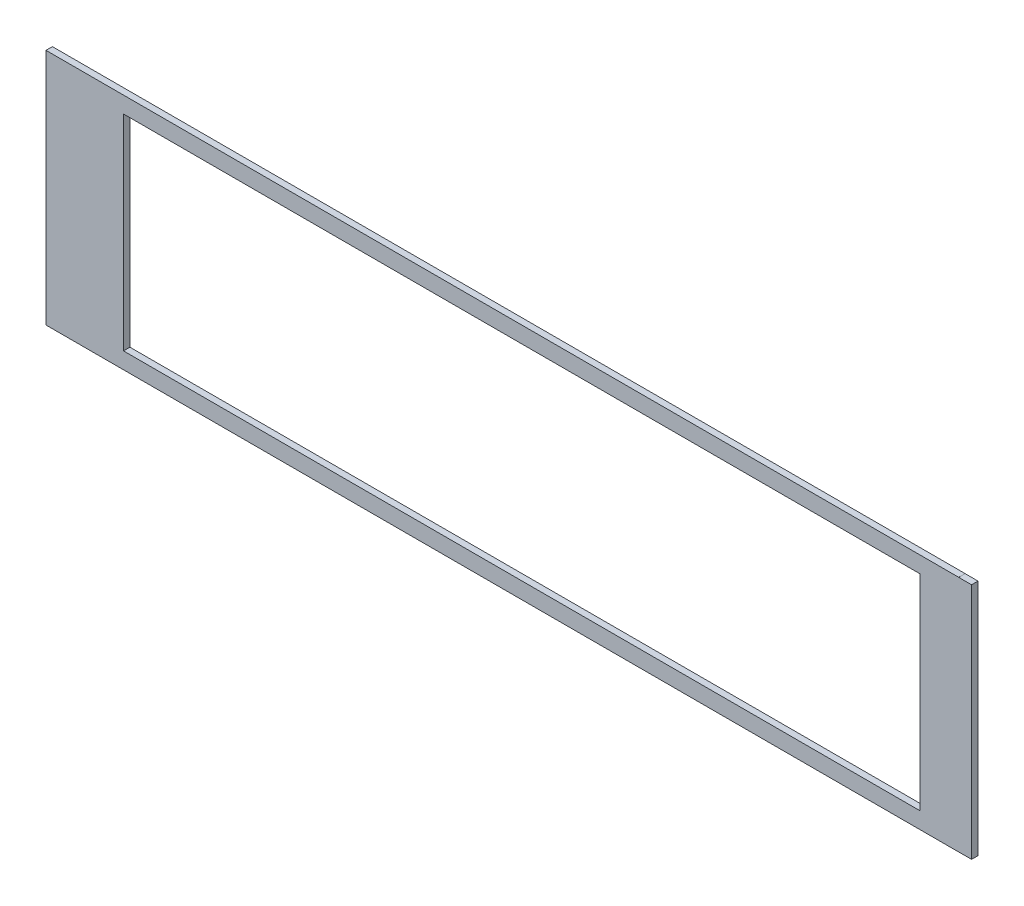
ISO-10303-21;
HEADER;
FILE_DESCRIPTION(('STEP AP214'),'2;1');
FILE_NAME('part.step','',(''),(''),'','','');
FILE_SCHEMA(('AUTOMOTIVE_DESIGN { 1 0 10303 214 1 1 1 1 }'));
ENDSEC;
DATA;
#1=APPLICATION_CONTEXT('core data for automotive mechanical design processes');
#2=APPLICATION_PROTOCOL_DEFINITION('international standard','automotive_design',2000,#1);
#3=PRODUCT_CONTEXT('',#1,'mechanical');
#4=PRODUCT('Part','Part','',(#3));
#5=PRODUCT_RELATED_PRODUCT_CATEGORY('part','',(#4));
#6=PRODUCT_DEFINITION_FORMATION('','',#4);
#7=PRODUCT_DEFINITION_CONTEXT('part definition',#1,'design');
#8=PRODUCT_DEFINITION('design','',#6,#7);
#9=PRODUCT_DEFINITION_SHAPE('','',#8);
#10=(LENGTH_UNIT() NAMED_UNIT(*) SI_UNIT(.MILLI.,.METRE.));
#11=(NAMED_UNIT(*) PLANE_ANGLE_UNIT() SI_UNIT($,.RADIAN.));
#12=(NAMED_UNIT(*) SI_UNIT($,.STERADIAN.) SOLID_ANGLE_UNIT());
#13=UNCERTAINTY_MEASURE_WITH_UNIT(LENGTH_MEASURE(1.E-05),#10,'distance_accuracy_value','');
#14=(GEOMETRIC_REPRESENTATION_CONTEXT(3) GLOBAL_UNCERTAINTY_ASSIGNED_CONTEXT((#13)) GLOBAL_UNIT_ASSIGNED_CONTEXT((#10,
#11,#12)) REPRESENTATION_CONTEXT('',''));
#15=CARTESIAN_POINT('',(0.,0.,0.));
#16=DIRECTION('',(0.,0.,1.));
#17=DIRECTION('',(1.,0.,0.));
#18=AXIS2_PLACEMENT_3D('',#15,#16,#17);
#19=CARTESIAN_POINT('',(0.,0.,3.175));
#20=DIRECTION('',(0.,0.,1.));
#21=DIRECTION('',(1.,0.,0.));
#22=AXIS2_PLACEMENT_3D('',#19,#20,#21);
#23=PLANE('',#22);
#24=DIRECTION('',(0.,1.,0.));
#25=VECTOR('',#24,1.);
#26=CARTESIAN_POINT('',(222.3516,58.759725,3.175));
#27=LINE('',#26,#25);
#28=CARTESIAN_POINT('',(222.3516,58.759725,3.175));
#29=VERTEX_POINT('',#28);
#30=CARTESIAN_POINT('',(222.3516,58.785125,3.175));
#31=VERTEX_POINT('',#30);
#32=EDGE_CURVE('E177',#29,#31,#27,.T.);
#33=ORIENTED_EDGE('',*,*,#32,.T.);
#34=DIRECTION('',(-1.,0.,0.));
#35=VECTOR('',#34,1.);
#36=CARTESIAN_POINT('',(222.3516,58.785125,3.175));
#37=LINE('',#36,#35);
#38=CARTESIAN_POINT('',(-228.7016,58.785125,3.175));
#39=VERTEX_POINT('',#38);
#40=EDGE_CURVE('E181',#31,#39,#37,.T.);
#41=ORIENTED_EDGE('',*,*,#40,.T.);
#42=DIRECTION('',(0.,-1.,0.));
#43=VECTOR('',#42,1.);
#44=CARTESIAN_POINT('',(-228.7016,58.785125,3.175));
#45=LINE('',#44,#43);
#46=CARTESIAN_POINT('',(-228.7016,-58.785125,3.175));
#47=VERTEX_POINT('',#46);
#48=EDGE_CURVE('E185',#39,#47,#45,.T.);
#49=ORIENTED_EDGE('',*,*,#48,.T.);
#50=DIRECTION('',(1.,0.,0.));
#51=VECTOR('',#50,1.);
#52=CARTESIAN_POINT('',(-228.7016,-58.785125,3.175));
#53=LINE('',#52,#51);
#54=CARTESIAN_POINT('',(222.3516,-58.785125,3.175));
#55=VERTEX_POINT('',#54);
#56=EDGE_CURVE('E188',#47,#55,#53,.T.);
#57=ORIENTED_EDGE('',*,*,#56,.T.);
#58=DIRECTION('',(0.,1.,0.));
#59=VECTOR('',#58,1.);
#60=CARTESIAN_POINT('',(222.3516,-58.785125,3.175));
#61=LINE('',#60,#59);
#62=CARTESIAN_POINT('',(222.3516,-58.759725,3.175));
#63=VERTEX_POINT('',#62);
#64=EDGE_CURVE('E191',#55,#63,#61,.T.);
#65=ORIENTED_EDGE('',*,*,#64,.T.);
#66=DIRECTION('',(1.,0.,0.));
#67=VECTOR('',#66,1.);
#68=CARTESIAN_POINT('',(222.3516,-58.759725,3.175));
#69=LINE('',#68,#67);
#70=CARTESIAN_POINT('',(228.7016,-58.759725,3.175));
#71=VERTEX_POINT('',#70);
#72=EDGE_CURVE('E194',#63,#71,#69,.T.);
#73=ORIENTED_EDGE('',*,*,#72,.T.);
#74=DIRECTION('',(0.,1.,0.));
#75=VECTOR('',#74,1.);
#76=CARTESIAN_POINT('',(228.7016,-58.759725,3.175));
#77=LINE('',#76,#75);
#78=CARTESIAN_POINT('',(228.7016,58.759725,3.175));
#79=VERTEX_POINT('',#78);
#80=EDGE_CURVE('E197',#71,#79,#77,.T.);
#81=ORIENTED_EDGE('',*,*,#80,.T.);
#82=DIRECTION('',(-1.,0.,0.));
#83=VECTOR('',#82,1.);
#84=CARTESIAN_POINT('',(228.7016,58.759725,3.175));
#85=LINE('',#84,#83);
#86=EDGE_CURVE('E200',#79,#29,#85,.T.);
#87=ORIENTED_EDGE('',*,*,#86,.T.);
#88=EDGE_LOOP('',(#33,#41,#49,#57,#65,#73,#81,#87));
#89=FACE_BOUND('',#88,.T.);
#90=DIRECTION('',(0.,-1.,0.));
#91=VECTOR('',#90,1.);
#92=CARTESIAN_POINT('',(-190.3984,50.6984,3.175));
#93=LINE('',#92,#91);
#94=CARTESIAN_POINT('',(-190.3984,50.6984,3.175));
#95=VERTEX_POINT('',#94);
#96=CARTESIAN_POINT('',(-190.3984,-50.6984,3.175));
#97=VERTEX_POINT('',#96);
#98=EDGE_CURVE('E138',#95,#97,#93,.T.);
#99=ORIENTED_EDGE('',*,*,#98,.F.);
#100=DIRECTION('',(-1.,0.,0.));
#101=VECTOR('',#100,1.);
#102=CARTESIAN_POINT('',(203.0984,50.6984,3.175));
#103=LINE('',#102,#101);
#104=CARTESIAN_POINT('',(203.0984,50.6984,3.175));
#105=VERTEX_POINT('',#104);
#106=EDGE_CURVE('E129',#105,#95,#103,.T.);
#107=ORIENTED_EDGE('',*,*,#106,.F.);
#108=DIRECTION('',(0.,1.,0.));
#109=VECTOR('',#108,1.);
#110=CARTESIAN_POINT('',(203.0984,-50.6984,3.175));
#111=LINE('',#110,#109);
#112=CARTESIAN_POINT('',(203.0984,-50.6984,3.175));
#113=VERTEX_POINT('',#112);
#114=EDGE_CURVE('E155',#113,#105,#111,.T.);
#115=ORIENTED_EDGE('',*,*,#114,.F.);
#116=DIRECTION('',(1.,0.,0.));
#117=VECTOR('',#116,1.);
#118=CARTESIAN_POINT('',(-190.3984,-50.6984,3.175));
#119=LINE('',#118,#117);
#120=EDGE_CURVE('E151',#97,#113,#119,.T.);
#121=ORIENTED_EDGE('',*,*,#120,.F.);
#122=EDGE_LOOP('',(#99,#107,#115,#121));
#123=FACE_BOUND('',#122,.T.);
#124=ADVANCED_FACE('F39',(#89,#123),#23,.T.);
#125=CARTESIAN_POINT('',(0.,0.,0.));
#126=DIRECTION('',(0.,0.,1.));
#127=DIRECTION('',(1.,0.,0.));
#128=AXIS2_PLACEMENT_3D('',#125,#126,#127);
#129=PLANE('',#128);
#130=DIRECTION('',(0.,1.,0.));
#131=VECTOR('',#130,1.);
#132=CARTESIAN_POINT('',(222.3516,58.759725,0.));
#133=LINE('',#132,#131);
#134=CARTESIAN_POINT('',(222.3516,58.759725,0.));
#135=VERTEX_POINT('',#134);
#136=CARTESIAN_POINT('',(222.3516,58.785125,0.));
#137=VERTEX_POINT('',#136);
#138=EDGE_CURVE('E147',#135,#137,#133,.T.);
#139=ORIENTED_EDGE('',*,*,#138,.F.);
#140=DIRECTION('',(-1.,0.,0.));
#141=VECTOR('',#140,1.);
#142=CARTESIAN_POINT('',(228.7016,58.759725,0.));
#143=LINE('',#142,#141);
#144=CARTESIAN_POINT('',(228.7016,58.759725,0.));
#145=VERTEX_POINT('',#144);
#146=EDGE_CURVE('E182',#145,#135,#143,.T.);
#147=ORIENTED_EDGE('',*,*,#146,.F.);
#148=DIRECTION('',(0.,1.,0.));
#149=VECTOR('',#148,1.);
#150=CARTESIAN_POINT('',(228.7016,-58.759725,0.));
#151=LINE('',#150,#149);
#152=CARTESIAN_POINT('',(228.7016,-58.759725,0.));
#153=VERTEX_POINT('',#152);
#154=EDGE_CURVE('E222',#153,#145,#151,.T.);
#155=ORIENTED_EDGE('',*,*,#154,.F.);
#156=DIRECTION('',(1.,0.,0.));
#157=VECTOR('',#156,1.);
#158=CARTESIAN_POINT('',(222.3516,-58.759725,0.));
#159=LINE('',#158,#157);
#160=CARTESIAN_POINT('',(222.3516,-58.759725,0.));
#161=VERTEX_POINT('',#160);
#162=EDGE_CURVE('E219',#161,#153,#159,.T.);
#163=ORIENTED_EDGE('',*,*,#162,.F.);
#164=DIRECTION('',(0.,1.,0.));
#165=VECTOR('',#164,1.);
#166=CARTESIAN_POINT('',(222.3516,-58.785125,0.));
#167=LINE('',#166,#165);
#168=CARTESIAN_POINT('',(222.3516,-58.785125,0.));
#169=VERTEX_POINT('',#168);
#170=EDGE_CURVE('E216',#169,#161,#167,.T.);
#171=ORIENTED_EDGE('',*,*,#170,.F.);
#172=DIRECTION('',(1.,0.,0.));
#173=VECTOR('',#172,1.);
#174=CARTESIAN_POINT('',(-228.7016,-58.785125,0.));
#175=LINE('',#174,#173);
#176=CARTESIAN_POINT('',(-228.7016,-58.785125,0.));
#177=VERTEX_POINT('',#176);
#178=EDGE_CURVE('E213',#177,#169,#175,.T.);
#179=ORIENTED_EDGE('',*,*,#178,.F.);
#180=DIRECTION('',(0.,-1.,0.));
#181=VECTOR('',#180,1.);
#182=CARTESIAN_POINT('',(-228.7016,58.785125,0.));
#183=LINE('',#182,#181);
#184=CARTESIAN_POINT('',(-228.7016,58.785125,0.));
#185=VERTEX_POINT('',#184);
#186=EDGE_CURVE('E210',#185,#177,#183,.T.);
#187=ORIENTED_EDGE('',*,*,#186,.F.);
#188=DIRECTION('',(-1.,0.,0.));
#189=VECTOR('',#188,1.);
#190=CARTESIAN_POINT('',(222.3516,58.785125,0.));
#191=LINE('',#190,#189);
#192=EDGE_CURVE('E207',#137,#185,#191,.T.);
#193=ORIENTED_EDGE('',*,*,#192,.F.);
#194=EDGE_LOOP('',(#139,#147,#155,#163,#171,#179,#187,#193));
#195=FACE_BOUND('',#194,.T.);
#196=DIRECTION('',(-1.,0.,0.));
#197=VECTOR('',#196,1.);
#198=CARTESIAN_POINT('',(203.0984,50.6984,0.));
#199=LINE('',#198,#197);
#200=CARTESIAN_POINT('',(203.0984,50.6984,0.));
#201=VERTEX_POINT('',#200);
#202=CARTESIAN_POINT('',(-190.3984,50.6984,0.));
#203=VERTEX_POINT('',#202);
#204=EDGE_CURVE('E63',#201,#203,#199,.T.);
#205=ORIENTED_EDGE('',*,*,#204,.T.);
#206=DIRECTION('',(0.,-1.,0.));
#207=VECTOR('',#206,1.);
#208=CARTESIAN_POINT('',(-190.3984,50.6984,0.));
#209=LINE('',#208,#207);
#210=CARTESIAN_POINT('',(-190.3984,-50.6984,0.));
#211=VERTEX_POINT('',#210);
#212=EDGE_CURVE('E145',#203,#211,#209,.T.);
#213=ORIENTED_EDGE('',*,*,#212,.T.);
#214=DIRECTION('',(1.,0.,0.));
#215=VECTOR('',#214,1.);
#216=CARTESIAN_POINT('',(-190.3984,-50.6984,0.));
#217=LINE('',#216,#215);
#218=CARTESIAN_POINT('',(203.0984,-50.6984,0.));
#219=VERTEX_POINT('',#218);
#220=EDGE_CURVE('E164',#211,#219,#217,.T.);
#221=ORIENTED_EDGE('',*,*,#220,.T.);
#222=DIRECTION('',(0.,1.,0.));
#223=VECTOR('',#222,1.);
#224=CARTESIAN_POINT('',(203.0984,-50.6984,0.));
#225=LINE('',#224,#223);
#226=EDGE_CURVE('E139',#219,#201,#225,.T.);
#227=ORIENTED_EDGE('',*,*,#226,.T.);
#228=EDGE_LOOP('',(#205,#213,#221,#227));
#229=FACE_BOUND('',#228,.T.);
#230=ADVANCED_FACE('F261',(#195,#229),#129,.F.);
#231=CARTESIAN_POINT('',(222.3516,58.759725,3.175));
#232=DIRECTION('',(-1.,0.,0.));
#233=DIRECTION('',(0.,0.,1.));
#234=AXIS2_PLACEMENT_3D('',#231,#232,#233);
#235=PLANE('',#234);
#236=ORIENTED_EDGE('',*,*,#138,.T.);
#237=DIRECTION('',(0.,0.,-1.));
#238=VECTOR('',#237,1.);
#239=CARTESIAN_POINT('',(222.3516,58.785125,3.175));
#240=LINE('',#239,#238);
#241=EDGE_CURVE('E11',#31,#137,#240,.T.);
#242=ORIENTED_EDGE('',*,*,#241,.F.);
#243=ORIENTED_EDGE('',*,*,#32,.F.);
#244=DIRECTION('',(0.,0.,-1.));
#245=VECTOR('',#244,1.);
#246=CARTESIAN_POINT('',(222.3516,58.759725,3.175));
#247=LINE('',#246,#245);
#248=EDGE_CURVE('E203',#29,#135,#247,.T.);
#249=ORIENTED_EDGE('',*,*,#248,.T.);
#250=EDGE_LOOP('',(#236,#242,#243,#249));
#251=FACE_BOUND('',#250,.T.);
#252=ADVANCED_FACE('F41',(#251),#235,.F.);
#253=CARTESIAN_POINT('',(222.3516,58.785125,3.175));
#254=DIRECTION('',(0.,-1.,0.));
#255=DIRECTION('',(0.,0.,-1.));
#256=AXIS2_PLACEMENT_3D('',#253,#254,#255);
#257=PLANE('',#256);
#258=ORIENTED_EDGE('',*,*,#192,.T.);
#259=DIRECTION('',(0.,0.,-1.));
#260=VECTOR('',#259,1.);
#261=CARTESIAN_POINT('',(-228.7016,58.785125,3.175));
#262=LINE('',#261,#260);
#263=EDGE_CURVE('E48',#39,#185,#262,.T.);
#264=ORIENTED_EDGE('',*,*,#263,.F.);
#265=ORIENTED_EDGE('',*,*,#40,.F.);
#266=ORIENTED_EDGE('',*,*,#241,.T.);
#267=EDGE_LOOP('',(#258,#264,#265,#266));
#268=FACE_BOUND('',#267,.T.);
#269=ADVANCED_FACE('F278',(#268),#257,.F.);
#270=CARTESIAN_POINT('',(-228.7016,58.785125,3.175));
#271=DIRECTION('',(1.,0.,0.));
#272=DIRECTION('',(0.,0.,-1.));
#273=AXIS2_PLACEMENT_3D('',#270,#271,#272);
#274=PLANE('',#273);
#275=ORIENTED_EDGE('',*,*,#186,.T.);
#276=DIRECTION('',(0.,0.,-1.));
#277=VECTOR('',#276,1.);
#278=CARTESIAN_POINT('',(-228.7016,-58.785125,3.175));
#279=LINE('',#278,#277);
#280=EDGE_CURVE('E246',#47,#177,#279,.T.);
#281=ORIENTED_EDGE('',*,*,#280,.F.);
#282=ORIENTED_EDGE('',*,*,#48,.F.);
#283=ORIENTED_EDGE('',*,*,#263,.T.);
#284=EDGE_LOOP('',(#275,#281,#282,#283));
#285=FACE_BOUND('',#284,.T.);
#286=ADVANCED_FACE('F255',(#285),#274,.F.);
#287=CARTESIAN_POINT('',(-228.7016,-58.785125,3.175));
#288=DIRECTION('',(0.,1.,0.));
#289=DIRECTION('',(0.,0.,1.));
#290=AXIS2_PLACEMENT_3D('',#287,#288,#289);
#291=PLANE('',#290);
#292=ORIENTED_EDGE('',*,*,#178,.T.);
#293=DIRECTION('',(0.,0.,-1.));
#294=VECTOR('',#293,1.);
#295=CARTESIAN_POINT('',(222.3516,-58.785125,3.175));
#296=LINE('',#295,#294);
#297=EDGE_CURVE('E242',#55,#169,#296,.T.);
#298=ORIENTED_EDGE('',*,*,#297,.F.);
#299=ORIENTED_EDGE('',*,*,#56,.F.);
#300=ORIENTED_EDGE('',*,*,#280,.T.);
#301=EDGE_LOOP('',(#292,#298,#299,#300));
#302=FACE_BOUND('',#301,.T.);
#303=ADVANCED_FACE('F267',(#302),#291,.F.);
#304=CARTESIAN_POINT('',(222.3516,-58.785125,3.175));
#305=DIRECTION('',(-1.,0.,0.));
#306=DIRECTION('',(0.,0.,1.));
#307=AXIS2_PLACEMENT_3D('',#304,#305,#306);
#308=PLANE('',#307);
#309=ORIENTED_EDGE('',*,*,#170,.T.);
#310=DIRECTION('',(0.,0.,-1.));
#311=VECTOR('',#310,1.);
#312=CARTESIAN_POINT('',(222.3516,-58.759725,3.175));
#313=LINE('',#312,#311);
#314=EDGE_CURVE('E238',#63,#161,#313,.T.);
#315=ORIENTED_EDGE('',*,*,#314,.F.);
#316=ORIENTED_EDGE('',*,*,#64,.F.);
#317=ORIENTED_EDGE('',*,*,#297,.T.);
#318=EDGE_LOOP('',(#309,#315,#316,#317));
#319=FACE_BOUND('',#318,.T.);
#320=ADVANCED_FACE('F271',(#319),#308,.F.);
#321=CARTESIAN_POINT('',(222.3516,-58.759725,3.175));
#322=DIRECTION('',(0.,1.,0.));
#323=DIRECTION('',(0.,0.,1.));
#324=AXIS2_PLACEMENT_3D('',#321,#322,#323);
#325=PLANE('',#324);
#326=ORIENTED_EDGE('',*,*,#162,.T.);
#327=DIRECTION('',(0.,0.,-1.));
#328=VECTOR('',#327,1.);
#329=CARTESIAN_POINT('',(228.7016,-58.759725,3.175));
#330=LINE('',#329,#328);
#331=EDGE_CURVE('E234',#71,#153,#330,.T.);
#332=ORIENTED_EDGE('',*,*,#331,.F.);
#333=ORIENTED_EDGE('',*,*,#72,.F.);
#334=ORIENTED_EDGE('',*,*,#314,.T.);
#335=EDGE_LOOP('',(#326,#332,#333,#334));
#336=FACE_BOUND('',#335,.T.);
#337=ADVANCED_FACE('F291',(#336),#325,.F.);
#338=CARTESIAN_POINT('',(228.7016,-58.759725,3.175));
#339=DIRECTION('',(-1.,0.,0.));
#340=DIRECTION('',(0.,0.,1.));
#341=AXIS2_PLACEMENT_3D('',#338,#339,#340);
#342=PLANE('',#341);
#343=ORIENTED_EDGE('',*,*,#154,.T.);
#344=DIRECTION('',(0.,0.,-1.));
#345=VECTOR('',#344,1.);
#346=CARTESIAN_POINT('',(228.7016,58.759725,3.175));
#347=LINE('',#346,#345);
#348=EDGE_CURVE('E230',#79,#145,#347,.T.);
#349=ORIENTED_EDGE('',*,*,#348,.F.);
#350=ORIENTED_EDGE('',*,*,#80,.F.);
#351=ORIENTED_EDGE('',*,*,#331,.T.);
#352=EDGE_LOOP('',(#343,#349,#350,#351));
#353=FACE_BOUND('',#352,.T.);
#354=ADVANCED_FACE('F289',(#353),#342,.F.);
#355=CARTESIAN_POINT('',(228.7016,58.759725,3.175));
#356=DIRECTION('',(0.,-1.,0.));
#357=DIRECTION('',(0.,0.,-1.));
#358=AXIS2_PLACEMENT_3D('',#355,#356,#357);
#359=PLANE('',#358);
#360=ORIENTED_EDGE('',*,*,#146,.T.);
#361=ORIENTED_EDGE('',*,*,#248,.F.);
#362=ORIENTED_EDGE('',*,*,#86,.F.);
#363=ORIENTED_EDGE('',*,*,#348,.T.);
#364=EDGE_LOOP('',(#360,#361,#362,#363));
#365=FACE_BOUND('',#364,.T.);
#366=ADVANCED_FACE('F284',(#365),#359,.F.);
#367=CARTESIAN_POINT('',(203.0984,50.6984,3.175));
#368=DIRECTION('',(0.,-1.,0.));
#369=DIRECTION('',(0.,0.,-1.));
#370=AXIS2_PLACEMENT_3D('',#367,#368,#369);
#371=PLANE('',#370);
#372=ORIENTED_EDGE('',*,*,#204,.F.);
#373=DIRECTION('',(0.,0.,-1.));
#374=VECTOR('',#373,1.);
#375=CARTESIAN_POINT('',(203.0984,50.6984,3.175));
#376=LINE('',#375,#374);
#377=EDGE_CURVE('E133',#105,#201,#376,.T.);
#378=ORIENTED_EDGE('',*,*,#377,.F.);
#379=ORIENTED_EDGE('',*,*,#106,.T.);
#380=DIRECTION('',(0.,0.,-1.));
#381=VECTOR('',#380,1.);
#382=CARTESIAN_POINT('',(-190.3984,50.6984,3.175));
#383=LINE('',#382,#381);
#384=EDGE_CURVE('E132',#95,#203,#383,.T.);
#385=ORIENTED_EDGE('',*,*,#384,.T.);
#386=EDGE_LOOP('',(#372,#378,#379,#385));
#387=FACE_BOUND('',#386,.T.);
#388=ADVANCED_FACE('F131',(#387),#371,.T.);
#389=CARTESIAN_POINT('',(-190.3984,50.6984,3.175));
#390=DIRECTION('',(1.,0.,0.));
#391=DIRECTION('',(0.,0.,-1.));
#392=AXIS2_PLACEMENT_3D('',#389,#390,#391);
#393=PLANE('',#392);
#394=ORIENTED_EDGE('',*,*,#212,.F.);
#395=ORIENTED_EDGE('',*,*,#384,.F.);
#396=ORIENTED_EDGE('',*,*,#98,.T.);
#397=DIRECTION('',(0.,0.,-1.));
#398=VECTOR('',#397,1.);
#399=CARTESIAN_POINT('',(-190.3984,-50.6984,3.175));
#400=LINE('',#399,#398);
#401=EDGE_CURVE('E148',#97,#211,#400,.T.);
#402=ORIENTED_EDGE('',*,*,#401,.T.);
#403=EDGE_LOOP('',(#394,#395,#396,#402));
#404=FACE_BOUND('',#403,.T.);
#405=ADVANCED_FACE('F142',(#404),#393,.T.);
#406=CARTESIAN_POINT('',(-190.3984,-50.6984,3.175));
#407=DIRECTION('',(0.,1.,0.));
#408=DIRECTION('',(0.,0.,1.));
#409=AXIS2_PLACEMENT_3D('',#406,#407,#408);
#410=PLANE('',#409);
#411=ORIENTED_EDGE('',*,*,#220,.F.);
#412=ORIENTED_EDGE('',*,*,#401,.F.);
#413=ORIENTED_EDGE('',*,*,#120,.T.);
#414=DIRECTION('',(0.,0.,-1.));
#415=VECTOR('',#414,1.);
#416=CARTESIAN_POINT('',(203.0984,-50.6984,3.175));
#417=LINE('',#416,#415);
#418=EDGE_CURVE('E55',#113,#219,#417,.T.);
#419=ORIENTED_EDGE('',*,*,#418,.T.);
#420=EDGE_LOOP('',(#411,#412,#413,#419));
#421=FACE_BOUND('',#420,.T.);
#422=ADVANCED_FACE('F316',(#421),#410,.T.);
#423=CARTESIAN_POINT('',(203.0984,-50.6984,3.175));
#424=DIRECTION('',(-1.,0.,0.));
#425=DIRECTION('',(0.,0.,1.));
#426=AXIS2_PLACEMENT_3D('',#423,#424,#425);
#427=PLANE('',#426);
#428=ORIENTED_EDGE('',*,*,#226,.F.);
#429=ORIENTED_EDGE('',*,*,#418,.F.);
#430=ORIENTED_EDGE('',*,*,#114,.T.);
#431=ORIENTED_EDGE('',*,*,#377,.T.);
#432=EDGE_LOOP('',(#428,#429,#430,#431));
#433=FACE_BOUND('',#432,.T.);
#434=ADVANCED_FACE('F320',(#433),#427,.T.);
#435=CLOSED_SHELL('',(#124,#230,#252,#269,#286,#303,#320,#337,#354,#366,#388,#405,#422,#434));
#436=MANIFOLD_SOLID_BREP('B2',#435);
#437=ADVANCED_BREP_SHAPE_REPRESENTATION('',(#18,#436),#14);
#438=SHAPE_DEFINITION_REPRESENTATION(#9,#437);
ENDSEC;
END-ISO-10303-21;
